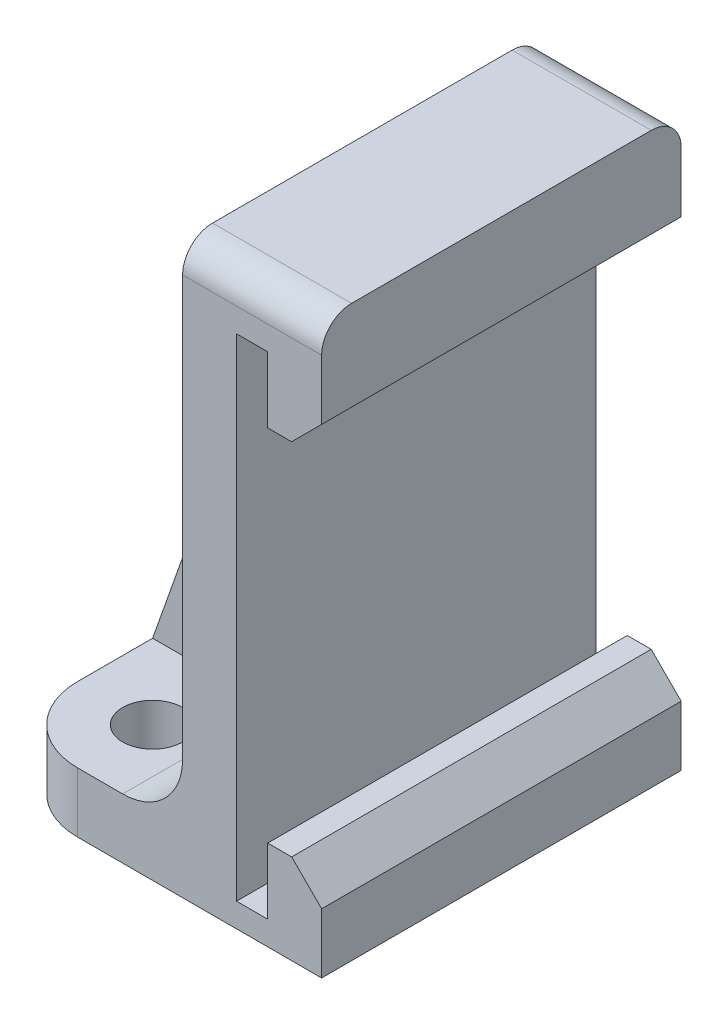
ISO-10303-21;
HEADER;
FILE_DESCRIPTION(('STEP AP214'),'2;1');
FILE_NAME('part.step','',(''),(''),'','','');
FILE_SCHEMA(('AUTOMOTIVE_DESIGN { 1 0 10303 214 1 1 1 1 }'));
ENDSEC;
DATA;
#1=APPLICATION_CONTEXT('core data for automotive mechanical design processes');
#2=APPLICATION_PROTOCOL_DEFINITION('international standard','automotive_design',2000,#1);
#3=PRODUCT_CONTEXT('',#1,'mechanical');
#4=PRODUCT('Part','Part','',(#3));
#5=PRODUCT_RELATED_PRODUCT_CATEGORY('part','',(#4));
#6=PRODUCT_DEFINITION_FORMATION('','',#4);
#7=PRODUCT_DEFINITION_CONTEXT('part definition',#1,'design');
#8=PRODUCT_DEFINITION('design','',#6,#7);
#9=PRODUCT_DEFINITION_SHAPE('','',#8);
#10=(LENGTH_UNIT() NAMED_UNIT(*) SI_UNIT(.MILLI.,.METRE.));
#11=(NAMED_UNIT(*) PLANE_ANGLE_UNIT() SI_UNIT($,.RADIAN.));
#12=(NAMED_UNIT(*) SI_UNIT($,.STERADIAN.) SOLID_ANGLE_UNIT());
#13=UNCERTAINTY_MEASURE_WITH_UNIT(LENGTH_MEASURE(1.E-05),#10,'distance_accuracy_value','');
#14=(GEOMETRIC_REPRESENTATION_CONTEXT(3) GLOBAL_UNCERTAINTY_ASSIGNED_CONTEXT((#13)) GLOBAL_UNIT_ASSIGNED_CONTEXT((#10,
#11,#12)) REPRESENTATION_CONTEXT('',''));
#15=CARTESIAN_POINT('',(0.,0.,0.));
#16=DIRECTION('',(0.,0.,1.));
#17=DIRECTION('',(1.,0.,0.));
#18=AXIS2_PLACEMENT_3D('',#15,#16,#17);
#19=CARTESIAN_POINT('',(-3.175,28.575,9.525));
#20=DIRECTION('',(1.,0.,0.));
#21=DIRECTION('',(0.,1.,0.));
#22=AXIS2_PLACEMENT_3D('',#19,#20,#21);
#23=PLANE('',#22);
#24=DIRECTION('',(0.,-1.,0.));
#25=VECTOR('',#24,1.);
#26=CARTESIAN_POINT('',(-3.175,28.575,9.525));
#27=LINE('',#26,#25);
#28=CARTESIAN_POINT('',(-3.175,26.9875,9.525));
#29=VERTEX_POINT('',#28);
#30=CARTESIAN_POINT('',(-3.175,4.7625,9.525));
#31=VERTEX_POINT('',#30);
#32=EDGE_CURVE('E262',#29,#31,#27,.T.);
#33=ORIENTED_EDGE('',*,*,#32,.F.);
#34=CARTESIAN_POINT('',(-3.175,26.9875,7.9375));
#35=DIRECTION('',(1.,0.,0.));
#36=DIRECTION('',(0.,1.,0.));
#37=AXIS2_PLACEMENT_3D('',#34,#35,#36);
#38=CIRCLE('',#37,1.5875);
#39=CARTESIAN_POINT('',(-3.175,28.575,7.9375));
#40=VERTEX_POINT('',#39);
#41=EDGE_CURVE('E206',#29,#40,#38,.F.);
#42=ORIENTED_EDGE('',*,*,#41,.T.);
#43=DIRECTION('',(0.,0.,-1.));
#44=VECTOR('',#43,1.);
#45=CARTESIAN_POINT('',(-3.175,28.575,9.525));
#46=LINE('',#45,#44);
#47=CARTESIAN_POINT('',(-3.175,28.575,1.5875));
#48=VERTEX_POINT('',#47);
#49=EDGE_CURVE('E200',#40,#48,#46,.T.);
#50=ORIENTED_EDGE('',*,*,#49,.T.);
#51=DIRECTION('',(0.,1.,0.));
#52=VECTOR('',#51,1.);
#53=CARTESIAN_POINT('',(-3.175,1.5875,1.5875));
#54=LINE('',#53,#52);
#55=CARTESIAN_POINT('',(-3.175,4.7625,1.5875));
#56=VERTEX_POINT('',#55);
#57=EDGE_CURVE('E204',#56,#48,#54,.T.);
#58=ORIENTED_EDGE('',*,*,#57,.F.);
#59=DIRECTION('',(0.,0.,-1.));
#60=VECTOR('',#59,1.);
#61=CARTESIAN_POINT('',(-3.175,4.7625,9.525));
#62=LINE('',#61,#60);
#63=EDGE_CURVE('E331',#56,#31,#62,.F.);
#64=ORIENTED_EDGE('',*,*,#63,.T.);
#65=EDGE_LOOP('',(#33,#42,#50,#58,#64));
#66=FACE_BOUND('',#65,.T.);
#67=ADVANCED_FACE('F33',(#66),#23,.F.);
#68=CARTESIAN_POINT('',(-12.7,1.5875,9.525));
#69=DIRECTION('',(0.,-1.,0.));
#70=DIRECTION('',(1.,0.,0.));
#71=AXIS2_PLACEMENT_3D('',#68,#69,#70);
#72=PLANE('',#71);
#73=CARTESIAN_POINT('',(-8.73125,1.5875,5.55625));
#74=DIRECTION('',(0.,1.,0.));
#75=DIRECTION('',(-1.,0.,0.));
#76=AXIS2_PLACEMENT_3D('',#73,#74,#75);
#77=CIRCLE('',#76,1.5875);
#78=CARTESIAN_POINT('',(-10.31875,1.5875,5.55625));
#79=VERTEX_POINT('',#78);
#80=EDGE_CURVE('E753',#79,#79,#77,.T.);
#81=ORIENTED_EDGE('',*,*,#80,.F.);
#82=EDGE_LOOP('',(#81));
#83=FACE_BOUND('',#82,.T.);
#84=DIRECTION('',(0.,0.,-1.));
#85=VECTOR('',#84,1.);
#86=CARTESIAN_POINT('',(-12.7,1.5875,9.525));
#87=LINE('',#86,#85);
#88=CARTESIAN_POINT('',(-12.7,1.5875,5.5626));
#89=VERTEX_POINT('',#88);
#90=CARTESIAN_POINT('',(-12.7,1.5875,1.5875));
#91=VERTEX_POINT('',#90);
#92=EDGE_CURVE('E312',#89,#91,#87,.T.);
#93=ORIENTED_EDGE('',*,*,#92,.F.);
#94=CARTESIAN_POINT('',(-8.7376,1.5875,5.5626));
#95=DIRECTION('',(0.,-1.,0.));
#96=DIRECTION('',(1.,0.,0.));
#97=AXIS2_PLACEMENT_3D('',#94,#95,#96);
#98=CIRCLE('',#97,3.9624);
#99=CARTESIAN_POINT('',(-8.7376,1.5875,9.525));
#100=VERTEX_POINT('',#99);
#101=EDGE_CURVE('E390',#89,#100,#98,.F.);
#102=ORIENTED_EDGE('',*,*,#101,.T.);
#103=DIRECTION('',(-1.,0.,0.));
#104=VECTOR('',#103,1.);
#105=CARTESIAN_POINT('',(-12.7,1.5875,9.525));
#106=LINE('',#105,#104);
#107=CARTESIAN_POINT('',(-6.35,1.5875,9.525));
#108=VERTEX_POINT('',#107);
#109=EDGE_CURVE('E264',#108,#100,#106,.T.);
#110=ORIENTED_EDGE('',*,*,#109,.F.);
#111=DIRECTION('',(0.,0.,-1.));
#112=VECTOR('',#111,1.);
#113=CARTESIAN_POINT('',(-6.35,1.5875,-9.525));
#114=LINE('',#113,#112);
#115=CARTESIAN_POINT('',(-6.35,1.5875,1.5875));
#116=VERTEX_POINT('',#115);
#117=EDGE_CURVE('E328',#108,#116,#114,.T.);
#118=ORIENTED_EDGE('',*,*,#117,.T.);
#119=DIRECTION('',(1.,0.,0.));
#120=VECTOR('',#119,1.);
#121=CARTESIAN_POINT('',(-12.7,1.5875,1.5875));
#122=LINE('',#121,#120);
#123=EDGE_CURVE('E231',#91,#116,#122,.T.);
#124=ORIENTED_EDGE('',*,*,#123,.F.);
#125=EDGE_LOOP('',(#93,#102,#110,#118,#124));
#126=FACE_BOUND('',#125,.T.);
#127=ADVANCED_FACE('F395',(#83,#126),#72,.F.);
#128=CARTESIAN_POINT('',(-6.35,4.7625,9.525));
#129=DIRECTION('',(0.,0.,1.));
#130=DIRECTION('',(1.,0.,0.));
#131=AXIS2_PLACEMENT_3D('',#128,#129,#130);
#132=CYLINDRICAL_SURFACE('',#131,3.175);
#133=CARTESIAN_POINT('',(-6.35,4.7625,1.5875));
#134=DIRECTION('',(0.,0.,-1.));
#135=DIRECTION('',(-1.,0.,0.));
#136=AXIS2_PLACEMENT_3D('',#133,#134,#135);
#137=CIRCLE('',#136,3.175);
#138=EDGE_CURVE('E220',#116,#56,#137,.F.);
#139=ORIENTED_EDGE('',*,*,#138,.F.);
#140=ORIENTED_EDGE('',*,*,#117,.F.);
#141=CARTESIAN_POINT('',(-6.35,4.7625,9.525));
#142=DIRECTION('',(0.,0.,-1.));
#143=DIRECTION('',(-1.,0.,0.));
#144=AXIS2_PLACEMENT_3D('',#141,#142,#143);
#145=CIRCLE('',#144,3.175);
#146=EDGE_CURVE('E338',#31,#108,#145,.T.);
#147=ORIENTED_EDGE('',*,*,#146,.F.);
#148=ORIENTED_EDGE('',*,*,#63,.F.);
#149=EDGE_LOOP('',(#139,#140,#147,#148));
#150=FACE_BOUND('',#149,.T.);
#151=ADVANCED_FACE('F475',(#150),#132,.F.);
#152=CARTESIAN_POINT('',(1.3335,-0.3175,9.525));
#153=DIRECTION('',(0.,-1.,0.));
#154=DIRECTION('',(1.,0.,0.));
#155=AXIS2_PLACEMENT_3D('',#152,#153,#154);
#156=PLANE('',#155);
#157=DIRECTION('',(-1.,0.,0.));
#158=VECTOR('',#157,1.);
#159=CARTESIAN_POINT('',(1.3335,-0.3175,-9.525));
#160=LINE('',#159,#158);
#161=CARTESIAN_POINT('',(1.3335,-0.3175,-9.525));
#162=VERTEX_POINT('',#161);
#163=CARTESIAN_POINT('',(-0.3175,-0.3175,-9.525));
#164=VERTEX_POINT('',#163);
#165=EDGE_CURVE('E238',#162,#164,#160,.T.);
#166=ORIENTED_EDGE('',*,*,#165,.T.);
#167=DIRECTION('',(0.,0.,-1.));
#168=VECTOR('',#167,1.);
#169=CARTESIAN_POINT('',(-0.3175,-0.3175,9.525));
#170=LINE('',#169,#168);
#171=CARTESIAN_POINT('',(-0.3175,-0.3175,9.525));
#172=VERTEX_POINT('',#171);
#173=EDGE_CURVE('E324',#172,#164,#170,.T.);
#174=ORIENTED_EDGE('',*,*,#173,.F.);
#175=DIRECTION('',(-1.,0.,0.));
#176=VECTOR('',#175,1.);
#177=CARTESIAN_POINT('',(1.3335,-0.3175,9.525));
#178=LINE('',#177,#176);
#179=CARTESIAN_POINT('',(1.3335,-0.3175,9.525));
#180=VERTEX_POINT('',#179);
#181=EDGE_CURVE('E246',#180,#172,#178,.T.);
#182=ORIENTED_EDGE('',*,*,#181,.F.);
#183=DIRECTION('',(0.,0.,-1.));
#184=VECTOR('',#183,1.);
#185=CARTESIAN_POINT('',(1.3335,-0.3175,9.525));
#186=LINE('',#185,#184);
#187=EDGE_CURVE('E275',#180,#162,#186,.T.);
#188=ORIENTED_EDGE('',*,*,#187,.T.);
#189=EDGE_LOOP('',(#166,#174,#182,#188));
#190=FACE_BOUND('',#189,.T.);
#191=ADVANCED_FACE('F436',(#190),#156,.F.);
#192=CARTESIAN_POINT('',(-0.3175,-0.3175,9.525));
#193=DIRECTION('',(-1.,0.,0.));
#194=DIRECTION('',(0.,0.,1.));
#195=AXIS2_PLACEMENT_3D('',#192,#193,#194);
#196=PLANE('',#195);
#197=DIRECTION('',(0.,1.,0.));
#198=VECTOR('',#197,1.);
#199=CARTESIAN_POINT('',(-0.3175,-0.3175,-9.525));
#200=LINE('',#199,#198);
#201=CARTESIAN_POINT('',(-0.3175,25.7175,-9.525));
#202=VERTEX_POINT('',#201);
#203=EDGE_CURVE('E241',#164,#202,#200,.T.);
#204=ORIENTED_EDGE('',*,*,#203,.T.);
#205=DIRECTION('',(0.,0.,-1.));
#206=VECTOR('',#205,1.);
#207=CARTESIAN_POINT('',(-0.3175,25.7175,9.525));
#208=LINE('',#207,#206);
#209=CARTESIAN_POINT('',(-0.3175,25.7175,9.525));
#210=VERTEX_POINT('',#209);
#211=EDGE_CURVE('E321',#210,#202,#208,.T.);
#212=ORIENTED_EDGE('',*,*,#211,.F.);
#213=DIRECTION('',(0.,1.,0.));
#214=VECTOR('',#213,1.);
#215=CARTESIAN_POINT('',(-0.3175,-0.3175,9.525));
#216=LINE('',#215,#214);
#217=EDGE_CURVE('E249',#172,#210,#216,.T.);
#218=ORIENTED_EDGE('',*,*,#217,.F.);
#219=ORIENTED_EDGE('',*,*,#173,.T.);
#220=EDGE_LOOP('',(#204,#212,#218,#219));
#221=FACE_BOUND('',#220,.T.);
#222=ADVANCED_FACE('F442',(#221),#196,.F.);
#223=CARTESIAN_POINT('',(-0.3175,25.7175,9.525));
#224=DIRECTION('',(0.,1.,0.));
#225=DIRECTION('',(0.,0.,1.));
#226=AXIS2_PLACEMENT_3D('',#223,#224,#225);
#227=PLANE('',#226);
#228=DIRECTION('',(1.,0.,0.));
#229=VECTOR('',#228,1.);
#230=CARTESIAN_POINT('',(-0.3175,25.7175,-9.525));
#231=LINE('',#230,#229);
#232=CARTESIAN_POINT('',(1.3335,25.7175,-9.525));
#233=VERTEX_POINT('',#232);
#234=EDGE_CURVE('E278',#202,#233,#231,.T.);
#235=ORIENTED_EDGE('',*,*,#234,.T.);
#236=DIRECTION('',(0.,0.,-1.));
#237=VECTOR('',#236,1.);
#238=CARTESIAN_POINT('',(1.3335,25.7175,9.525));
#239=LINE('',#238,#237);
#240=CARTESIAN_POINT('',(1.3335,25.7175,9.525));
#241=VERTEX_POINT('',#240);
#242=EDGE_CURVE('E318',#241,#233,#239,.T.);
#243=ORIENTED_EDGE('',*,*,#242,.F.);
#244=DIRECTION('',(1.,0.,0.));
#245=VECTOR('',#244,1.);
#246=CARTESIAN_POINT('',(-0.3175,25.7175,9.525));
#247=LINE('',#246,#245);
#248=EDGE_CURVE('E252',#210,#241,#247,.T.);
#249=ORIENTED_EDGE('',*,*,#248,.F.);
#250=ORIENTED_EDGE('',*,*,#211,.T.);
#251=EDGE_LOOP('',(#235,#243,#249,#250));
#252=FACE_BOUND('',#251,.T.);
#253=ADVANCED_FACE('F445',(#252),#227,.F.);
#254=CARTESIAN_POINT('',(1.3335,25.7175,9.525));
#255=DIRECTION('',(1.,0.,0.));
#256=DIRECTION('',(0.,1.,0.));
#257=AXIS2_PLACEMENT_3D('',#254,#255,#256);
#258=PLANE('',#257);
#259=DIRECTION('',(0.,-1.,0.));
#260=VECTOR('',#259,1.);
#261=CARTESIAN_POINT('',(1.3335,25.7175,-9.525));
#262=LINE('',#261,#260);
#263=CARTESIAN_POINT('',(1.3335,22.225,-9.525));
#264=VERTEX_POINT('',#263);
#265=EDGE_CURVE('E280',#233,#264,#262,.T.);
#266=ORIENTED_EDGE('',*,*,#265,.T.);
#267=DIRECTION('',(0.,0.,-1.));
#268=VECTOR('',#267,1.);
#269=CARTESIAN_POINT('',(1.3335,22.225,9.525));
#270=LINE('',#269,#268);
#271=CARTESIAN_POINT('',(1.3335,22.225,9.525));
#272=VERTEX_POINT('',#271);
#273=EDGE_CURVE('E315',#272,#264,#270,.T.);
#274=ORIENTED_EDGE('',*,*,#273,.F.);
#275=DIRECTION('',(0.,-1.,0.));
#276=VECTOR('',#275,1.);
#277=CARTESIAN_POINT('',(1.3335,25.7175,9.525));
#278=LINE('',#277,#276);
#279=EDGE_CURVE('E254',#241,#272,#278,.T.);
#280=ORIENTED_EDGE('',*,*,#279,.F.);
#281=ORIENTED_EDGE('',*,*,#242,.T.);
#282=EDGE_LOOP('',(#266,#274,#280,#281));
#283=FACE_BOUND('',#282,.T.);
#284=ADVANCED_FACE('F450',(#283),#258,.F.);
#285=CARTESIAN_POINT('',(4.191,22.225,9.525));
#286=DIRECTION('',(0.,1.,0.));
#287=DIRECTION('',(0.,0.,1.));
#288=AXIS2_PLACEMENT_3D('',#285,#286,#287);
#289=PLANE('',#288);
#290=DIRECTION('',(1.,0.,0.));
#291=VECTOR('',#290,1.);
#292=CARTESIAN_POINT('',(4.191,22.225,-9.525));
#293=LINE('',#292,#291);
#294=CARTESIAN_POINT('',(2.60349999999999,22.225,-9.525));
#295=VERTEX_POINT('',#294);
#296=EDGE_CURVE('E282',#264,#295,#293,.T.);
#297=ORIENTED_EDGE('',*,*,#296,.T.);
#298=DIRECTION('',(0.,0.,1.));
#299=VECTOR('',#298,1.);
#300=CARTESIAN_POINT('',(2.60349999999999,22.225,9.525));
#301=LINE('',#300,#299);
#302=CARTESIAN_POINT('',(2.60349999999999,22.225,9.525));
#303=VERTEX_POINT('',#302);
#304=EDGE_CURVE('E360',#295,#303,#301,.T.);
#305=ORIENTED_EDGE('',*,*,#304,.T.);
#306=DIRECTION('',(1.,0.,0.));
#307=VECTOR('',#306,1.);
#308=CARTESIAN_POINT('',(4.191,22.225,9.525));
#309=LINE('',#308,#307);
#310=EDGE_CURVE('E256',#272,#303,#309,.T.);
#311=ORIENTED_EDGE('',*,*,#310,.F.);
#312=ORIENTED_EDGE('',*,*,#273,.T.);
#313=EDGE_LOOP('',(#297,#305,#311,#312));
#314=FACE_BOUND('',#313,.T.);
#315=ADVANCED_FACE('F520',(#314),#289,.F.);
#316=CARTESIAN_POINT('',(4.19099999999999,28.575,9.525));
#317=DIRECTION('',(-1.,0.,0.));
#318=DIRECTION('',(0.,-1.,0.));
#319=AXIS2_PLACEMENT_3D('',#316,#317,#318);
#320=PLANE('',#319);
#321=DIRECTION('',(0.,1.,0.));
#322=VECTOR('',#321,1.);
#323=CARTESIAN_POINT('',(4.19099999999999,28.575,-9.525));
#324=LINE('',#323,#322);
#325=CARTESIAN_POINT('',(4.191,23.8125,-9.525));
#326=VERTEX_POINT('',#325);
#327=CARTESIAN_POINT('',(4.19099999999999,26.9875,-9.525));
#328=VERTEX_POINT('',#327);
#329=EDGE_CURVE('E285',#326,#328,#324,.T.);
#330=ORIENTED_EDGE('',*,*,#329,.T.);
#331=CARTESIAN_POINT('',(4.19099999999999,26.9875,-7.9375));
#332=DIRECTION('',(-1.,0.,0.));
#333=DIRECTION('',(0.,-1.,0.));
#334=AXIS2_PLACEMENT_3D('',#331,#332,#333);
#335=CIRCLE('',#334,1.5875);
#336=CARTESIAN_POINT('',(4.19099999999999,28.575,-7.93749999999999));
#337=VERTEX_POINT('',#336);
#338=EDGE_CURVE('E372',#328,#337,#335,.F.);
#339=ORIENTED_EDGE('',*,*,#338,.T.);
#340=DIRECTION('',(0.,0.,-1.));
#341=VECTOR('',#340,1.);
#342=CARTESIAN_POINT('',(4.19099999999999,28.575,9.525));
#343=LINE('',#342,#341);
#344=CARTESIAN_POINT('',(4.19099999999999,28.575,7.9375));
#345=VERTEX_POINT('',#344);
#346=EDGE_CURVE('E210',#345,#337,#343,.T.);
#347=ORIENTED_EDGE('',*,*,#346,.F.);
#348=CARTESIAN_POINT('',(4.19099999999999,26.9875,7.9375));
#349=DIRECTION('',(-1.,0.,0.));
#350=DIRECTION('',(0.,-1.,0.));
#351=AXIS2_PLACEMENT_3D('',#348,#349,#350);
#352=CIRCLE('',#351,1.5875);
#353=CARTESIAN_POINT('',(4.19099999999999,26.9875,9.525));
#354=VERTEX_POINT('',#353);
#355=EDGE_CURVE('E370',#345,#354,#352,.F.);
#356=ORIENTED_EDGE('',*,*,#355,.T.);
#357=DIRECTION('',(0.,1.,0.));
#358=VECTOR('',#357,1.);
#359=CARTESIAN_POINT('',(4.19099999999999,28.575,9.525));
#360=LINE('',#359,#358);
#361=CARTESIAN_POINT('',(4.191,23.8125,9.525));
#362=VERTEX_POINT('',#361);
#363=EDGE_CURVE('E259',#362,#354,#360,.T.);
#364=ORIENTED_EDGE('',*,*,#363,.F.);
#365=DIRECTION('',(0.,0.,-1.));
#366=VECTOR('',#365,1.);
#367=CARTESIAN_POINT('',(4.191,23.8125,9.525));
#368=LINE('',#367,#366);
#369=EDGE_CURVE('E357',#362,#326,#368,.T.);
#370=ORIENTED_EDGE('',*,*,#369,.T.);
#371=EDGE_LOOP('',(#330,#339,#347,#356,#364,#370));
#372=FACE_BOUND('',#371,.T.);
#373=ADVANCED_FACE('F461',(#372),#320,.F.);
#374=CARTESIAN_POINT('',(1.016,28.575,9.525));
#375=DIRECTION('',(0.,-1.,0.));
#376=DIRECTION('',(0.,0.,-1.));
#377=AXIS2_PLACEMENT_3D('',#374,#375,#376);
#378=PLANE('',#377);
#379=ORIENTED_EDGE('',*,*,#346,.T.);
#380=DIRECTION('',(-1.,0.,0.));
#381=VECTOR('',#380,1.);
#382=CARTESIAN_POINT('',(-3.175,28.575,-7.9375));
#383=LINE('',#382,#381);
#384=CARTESIAN_POINT('',(-3.175,28.575,-7.93749999999999));
#385=VERTEX_POINT('',#384);
#386=EDGE_CURVE('E364',#337,#385,#383,.T.);
#387=ORIENTED_EDGE('',*,*,#386,.T.);
#388=CARTESIAN_POINT('',(-3.175,28.575,-1.5875));
#389=VERTEX_POINT('',#388);
#390=EDGE_CURVE('E211',#389,#385,#46,.T.);
#391=ORIENTED_EDGE('',*,*,#390,.F.);
#392=DIRECTION('',(0.,0.,-1.));
#393=VECTOR('',#392,1.);
#394=CARTESIAN_POINT('',(-3.175,28.575,1.5875));
#395=LINE('',#394,#393);
#396=EDGE_CURVE('E226',#48,#389,#395,.T.);
#397=ORIENTED_EDGE('',*,*,#396,.F.);
#398=ORIENTED_EDGE('',*,*,#49,.F.);
#399=DIRECTION('',(-1.,0.,0.));
#400=VECTOR('',#399,1.);
#401=CARTESIAN_POINT('',(1.016,28.575,7.9375));
#402=LINE('',#401,#400);
#403=EDGE_CURVE('E362',#40,#345,#402,.F.);
#404=ORIENTED_EDGE('',*,*,#403,.T.);
#405=EDGE_LOOP('',(#379,#387,#391,#397,#398,#404));
#406=FACE_BOUND('',#405,.T.);
#407=ADVANCED_FACE('F235',(#406),#378,.F.);
#408=ORIENTED_EDGE('',*,*,#390,.T.);
#409=CARTESIAN_POINT('',(-3.175,26.9875,-7.9375));
#410=DIRECTION('',(1.,0.,0.));
#411=DIRECTION('',(0.,1.,0.));
#412=AXIS2_PLACEMENT_3D('',#409,#410,#411);
#413=CIRCLE('',#412,1.5875);
#414=CARTESIAN_POINT('',(-3.175,26.9875,-9.525));
#415=VERTEX_POINT('',#414);
#416=EDGE_CURVE('E366',#385,#415,#413,.F.);
#417=ORIENTED_EDGE('',*,*,#416,.T.);
#418=DIRECTION('',(0.,-1.,0.));
#419=VECTOR('',#418,1.);
#420=CARTESIAN_POINT('',(-3.175,28.575,-9.525));
#421=LINE('',#420,#419);
#422=CARTESIAN_POINT('',(-3.175,4.7625,-9.525));
#423=VERTEX_POINT('',#422);
#424=EDGE_CURVE('E288',#415,#423,#421,.T.);
#425=ORIENTED_EDGE('',*,*,#424,.T.);
#426=CARTESIAN_POINT('',(-3.175,4.7625,-1.5875));
#427=VERTEX_POINT('',#426);
#428=EDGE_CURVE('E332',#423,#427,#62,.F.);
#429=ORIENTED_EDGE('',*,*,#428,.T.);
#430=DIRECTION('',(0.,1.,0.));
#431=VECTOR('',#430,1.);
#432=CARTESIAN_POINT('',(-3.175,1.5875,-1.5875));
#433=LINE('',#432,#431);
#434=EDGE_CURVE('E478',#427,#389,#433,.T.);
#435=ORIENTED_EDGE('',*,*,#434,.T.);
#436=EDGE_LOOP('',(#408,#417,#425,#429,#435));
#437=FACE_BOUND('',#436,.T.);
#438=ADVANCED_FACE('F492',(#437),#23,.F.);
#439=CARTESIAN_POINT('',(-8.73125,1.5875,-5.55625));
#440=DIRECTION('',(0.,1.,0.));
#441=DIRECTION('',(-1.,0.,0.));
#442=AXIS2_PLACEMENT_3D('',#439,#440,#441);
#443=CIRCLE('',#442,1.5875);
#444=CARTESIAN_POINT('',(-10.31875,1.5875,-5.55625));
#445=VERTEX_POINT('',#444);
#446=EDGE_CURVE('E758',#445,#445,#443,.T.);
#447=ORIENTED_EDGE('',*,*,#446,.F.);
#448=EDGE_LOOP('',(#447));
#449=FACE_BOUND('',#448,.T.);
#450=DIRECTION('',(-1.,0.,0.));
#451=VECTOR('',#450,1.);
#452=CARTESIAN_POINT('',(-12.7,1.5875,-9.525));
#453=LINE('',#452,#451);
#454=CARTESIAN_POINT('',(-6.35,1.5875,-9.525));
#455=VERTEX_POINT('',#454);
#456=CARTESIAN_POINT('',(-8.7376,1.5875,-9.525));
#457=VERTEX_POINT('',#456);
#458=EDGE_CURVE('E290',#455,#457,#453,.T.);
#459=ORIENTED_EDGE('',*,*,#458,.T.);
#460=CARTESIAN_POINT('',(-8.7376,1.5875,-5.5626));
#461=DIRECTION('',(0.,-1.,0.));
#462=DIRECTION('',(1.,0.,0.));
#463=AXIS2_PLACEMENT_3D('',#460,#461,#462);
#464=CIRCLE('',#463,3.9624);
#465=CARTESIAN_POINT('',(-12.7,1.5875,-5.5626));
#466=VERTEX_POINT('',#465);
#467=EDGE_CURVE('E11',#457,#466,#464,.F.);
#468=ORIENTED_EDGE('',*,*,#467,.T.);
#469=CARTESIAN_POINT('',(-12.7,1.5875,-1.5875));
#470=VERTEX_POINT('',#469);
#471=EDGE_CURVE('E311',#470,#466,#87,.T.);
#472=ORIENTED_EDGE('',*,*,#471,.F.);
#473=DIRECTION('',(1.,0.,0.));
#474=VECTOR('',#473,1.);
#475=CARTESIAN_POINT('',(-12.7,1.5875,-1.5875));
#476=LINE('',#475,#474);
#477=CARTESIAN_POINT('',(-6.35,1.5875,-1.5875));
#478=VERTEX_POINT('',#477);
#479=EDGE_CURVE('E221',#470,#478,#476,.T.);
#480=ORIENTED_EDGE('',*,*,#479,.T.);
#481=EDGE_CURVE('E327',#478,#455,#114,.T.);
#482=ORIENTED_EDGE('',*,*,#481,.T.);
#483=EDGE_LOOP('',(#459,#468,#472,#480,#482));
#484=FACE_BOUND('',#483,.T.);
#485=ADVANCED_FACE('F485',(#449,#484),#72,.F.);
#486=CARTESIAN_POINT('',(-12.7,-1.5875,9.525));
#487=DIRECTION('',(1.,0.,0.));
#488=DIRECTION('',(0.,0.,-1.));
#489=AXIS2_PLACEMENT_3D('',#486,#487,#488);
#490=PLANE('',#489);
#491=DIRECTION('',(0.,0.,-1.));
#492=VECTOR('',#491,1.);
#493=CARTESIAN_POINT('',(-12.7,-1.5875,9.525));
#494=LINE('',#493,#492);
#495=CARTESIAN_POINT('',(-12.7,-1.5875,5.5626));
#496=VERTEX_POINT('',#495);
#497=CARTESIAN_POINT('',(-12.7,-1.5875,-5.5626));
#498=VERTEX_POINT('',#497);
#499=EDGE_CURVE('E308',#496,#498,#494,.T.);
#500=ORIENTED_EDGE('',*,*,#499,.F.);
#501=DIRECTION('',(0.,-1.,0.));
#502=VECTOR('',#501,1.);
#503=CARTESIAN_POINT('',(-12.7,-1.5875,5.5626));
#504=LINE('',#503,#502);
#505=EDGE_CURVE('E388',#496,#89,#504,.F.);
#506=ORIENTED_EDGE('',*,*,#505,.T.);
#507=ORIENTED_EDGE('',*,*,#92,.T.);
#508=DIRECTION('',(0.,0.,-1.));
#509=VECTOR('',#508,1.);
#510=CARTESIAN_POINT('',(-12.7,1.5875,1.5875));
#511=LINE('',#510,#509);
#512=EDGE_CURVE('E229',#91,#470,#511,.T.);
#513=ORIENTED_EDGE('',*,*,#512,.T.);
#514=ORIENTED_EDGE('',*,*,#471,.T.);
#515=DIRECTION('',(0.,-1.,0.));
#516=VECTOR('',#515,1.);
#517=CARTESIAN_POINT('',(-12.7,-1.5875,-5.5626));
#518=LINE('',#517,#516);
#519=EDGE_CURVE('E385',#466,#498,#518,.T.);
#520=ORIENTED_EDGE('',*,*,#519,.T.);
#521=EDGE_LOOP('',(#500,#506,#507,#513,#514,#520));
#522=FACE_BOUND('',#521,.T.);
#523=ADVANCED_FACE('F410',(#522),#490,.F.);
#524=CARTESIAN_POINT('',(-3.175,-1.5875,9.525));
#525=DIRECTION('',(0.,1.,0.));
#526=DIRECTION('',(0.,0.,1.));
#527=AXIS2_PLACEMENT_3D('',#524,#525,#526);
#528=PLANE('',#527);
#529=CARTESIAN_POINT('',(-8.73125,-1.5875,-5.55625));
#530=DIRECTION('',(0.,1.,0.));
#531=DIRECTION('',(0.,0.,1.));
#532=AXIS2_PLACEMENT_3D('',#529,#530,#531);
#533=CIRCLE('',#532,1.5875);
#534=CARTESIAN_POINT('',(-8.73125,-1.5875,-3.96875));
#535=VERTEX_POINT('',#534);
#536=EDGE_CURVE('E754',#535,#535,#533,.F.);
#537=ORIENTED_EDGE('',*,*,#536,.F.);
#538=EDGE_LOOP('',(#537));
#539=FACE_BOUND('',#538,.T.);
#540=CARTESIAN_POINT('',(-8.73125,-1.5875,5.55625));
#541=DIRECTION('',(0.,1.,0.));
#542=DIRECTION('',(0.,0.,1.));
#543=AXIS2_PLACEMENT_3D('',#540,#541,#542);
#544=CIRCLE('',#543,1.5875);
#545=CARTESIAN_POINT('',(-8.73125,-1.5875,7.14375));
#546=VERTEX_POINT('',#545);
#547=EDGE_CURVE('E481',#546,#546,#544,.F.);
#548=ORIENTED_EDGE('',*,*,#547,.F.);
#549=EDGE_LOOP('',(#548));
#550=FACE_BOUND('',#549,.T.);
#551=DIRECTION('',(1.,0.,0.));
#552=VECTOR('',#551,1.);
#553=CARTESIAN_POINT('',(-3.175,-1.5875,9.525));
#554=LINE('',#553,#552);
#555=CARTESIAN_POINT('',(-8.7376,-1.5875,9.525));
#556=VERTEX_POINT('',#555);
#557=CARTESIAN_POINT('',(4.191,-1.5875,9.525));
#558=VERTEX_POINT('',#557);
#559=EDGE_CURVE('E267',#556,#558,#554,.T.);
#560=ORIENTED_EDGE('',*,*,#559,.F.);
#561=CARTESIAN_POINT('',(-8.7376,-1.5875,5.5626));
#562=DIRECTION('',(0.,1.,0.));
#563=DIRECTION('',(0.,0.,1.));
#564=AXIS2_PLACEMENT_3D('',#561,#562,#563);
#565=CIRCLE('',#564,3.9624);
#566=EDGE_CURVE('E383',#556,#496,#565,.F.);
#567=ORIENTED_EDGE('',*,*,#566,.T.);
#568=ORIENTED_EDGE('',*,*,#499,.T.);
#569=CARTESIAN_POINT('',(-8.7376,-1.5875,-5.5626));
#570=DIRECTION('',(0.,1.,0.));
#571=DIRECTION('',(0.,0.,1.));
#572=AXIS2_PLACEMENT_3D('',#569,#570,#571);
#573=CIRCLE('',#572,3.9624);
#574=CARTESIAN_POINT('',(-8.7376,-1.5875,-9.525));
#575=VERTEX_POINT('',#574);
#576=EDGE_CURVE('E381',#498,#575,#573,.F.);
#577=ORIENTED_EDGE('',*,*,#576,.T.);
#578=DIRECTION('',(1.,0.,0.));
#579=VECTOR('',#578,1.);
#580=CARTESIAN_POINT('',(-3.175,-1.5875,-9.525));
#581=LINE('',#580,#579);
#582=CARTESIAN_POINT('',(4.191,-1.5875,-9.525));
#583=VERTEX_POINT('',#582);
#584=EDGE_CURVE('E292',#575,#583,#581,.T.);
#585=ORIENTED_EDGE('',*,*,#584,.T.);
#586=DIRECTION('',(0.,0.,-1.));
#587=VECTOR('',#586,1.);
#588=CARTESIAN_POINT('',(4.191,-1.5875,9.525));
#589=LINE('',#588,#587);
#590=EDGE_CURVE('E305',#558,#583,#589,.T.);
#591=ORIENTED_EDGE('',*,*,#590,.F.);
#592=EDGE_LOOP('',(#560,#567,#568,#577,#585,#591));
#593=FACE_BOUND('',#592,.T.);
#594=ADVANCED_FACE('F407',(#539,#550,#593),#528,.F.);
#595=CARTESIAN_POINT('',(4.191,0.,9.525));
#596=DIRECTION('',(-1.,0.,0.));
#597=DIRECTION('',(0.,0.,1.));
#598=AXIS2_PLACEMENT_3D('',#595,#596,#597);
#599=PLANE('',#598);
#600=DIRECTION('',(0.,1.,0.));
#601=VECTOR('',#600,1.);
#602=CARTESIAN_POINT('',(4.191,0.,-9.525));
#603=LINE('',#602,#601);
#604=CARTESIAN_POINT('',(4.191,1.58750000000001,-9.525));
#605=VERTEX_POINT('',#604);
#606=EDGE_CURVE('E294',#583,#605,#603,.T.);
#607=ORIENTED_EDGE('',*,*,#606,.T.);
#608=DIRECTION('',(0.,0.,1.));
#609=VECTOR('',#608,1.);
#610=CARTESIAN_POINT('',(4.191,1.58750000000001,9.525));
#611=LINE('',#610,#609);
#612=CARTESIAN_POINT('',(4.191,1.58750000000001,9.525));
#613=VERTEX_POINT('',#612);
#614=EDGE_CURVE('E351',#605,#613,#611,.T.);
#615=ORIENTED_EDGE('',*,*,#614,.T.);
#616=DIRECTION('',(0.,1.,0.));
#617=VECTOR('',#616,1.);
#618=CARTESIAN_POINT('',(4.191,-1.5875,9.525));
#619=LINE('',#618,#617);
#620=EDGE_CURVE('E269',#558,#613,#619,.T.);
#621=ORIENTED_EDGE('',*,*,#620,.F.);
#622=ORIENTED_EDGE('',*,*,#590,.T.);
#623=EDGE_LOOP('',(#607,#615,#621,#622));
#624=FACE_BOUND('',#623,.T.);
#625=ADVANCED_FACE('F419',(#624),#599,.F.);
#626=CARTESIAN_POINT('',(4.191,3.175,9.525));
#627=DIRECTION('',(0.,-1.,0.));
#628=DIRECTION('',(1.,0.,0.));
#629=AXIS2_PLACEMENT_3D('',#626,#627,#628);
#630=PLANE('',#629);
#631=DIRECTION('',(-1.,0.,0.));
#632=VECTOR('',#631,1.);
#633=CARTESIAN_POINT('',(4.191,3.175,9.525));
#634=LINE('',#633,#632);
#635=CARTESIAN_POINT('',(2.60350000000001,3.175,9.525));
#636=VERTEX_POINT('',#635);
#637=CARTESIAN_POINT('',(1.3335,3.175,9.525));
#638=VERTEX_POINT('',#637);
#639=EDGE_CURVE('E272',#636,#638,#634,.T.);
#640=ORIENTED_EDGE('',*,*,#639,.F.);
#641=DIRECTION('',(0.,0.,-1.));
#642=VECTOR('',#641,1.);
#643=CARTESIAN_POINT('',(2.60350000000001,3.175,9.525));
#644=LINE('',#643,#642);
#645=CARTESIAN_POINT('',(2.60350000000001,3.175,-9.525));
#646=VERTEX_POINT('',#645);
#647=EDGE_CURVE('E344',#636,#646,#644,.T.);
#648=ORIENTED_EDGE('',*,*,#647,.T.);
#649=DIRECTION('',(-1.,0.,0.));
#650=VECTOR('',#649,1.);
#651=CARTESIAN_POINT('',(4.191,3.175,-9.525));
#652=LINE('',#651,#650);
#653=CARTESIAN_POINT('',(1.3335,3.175,-9.525));
#654=VERTEX_POINT('',#653);
#655=EDGE_CURVE('E297',#646,#654,#652,.T.);
#656=ORIENTED_EDGE('',*,*,#655,.T.);
#657=DIRECTION('',(0.,0.,-1.));
#658=VECTOR('',#657,1.);
#659=CARTESIAN_POINT('',(1.3335,3.175,9.525));
#660=LINE('',#659,#658);
#661=EDGE_CURVE('E302',#638,#654,#660,.T.);
#662=ORIENTED_EDGE('',*,*,#661,.F.);
#663=EDGE_LOOP('',(#640,#648,#656,#662));
#664=FACE_BOUND('',#663,.T.);
#665=ADVANCED_FACE('F426',(#664),#630,.F.);
#666=CARTESIAN_POINT('',(1.3335,3.175,9.525));
#667=DIRECTION('',(1.,0.,0.));
#668=DIRECTION('',(0.,1.,0.));
#669=AXIS2_PLACEMENT_3D('',#666,#667,#668);
#670=PLANE('',#669);
#671=DIRECTION('',(0.,-1.,0.));
#672=VECTOR('',#671,1.);
#673=CARTESIAN_POINT('',(1.3335,3.175,-9.525));
#674=LINE('',#673,#672);
#675=EDGE_CURVE('E250',#654,#162,#674,.T.);
#676=ORIENTED_EDGE('',*,*,#675,.T.);
#677=ORIENTED_EDGE('',*,*,#187,.F.);
#678=DIRECTION('',(0.,-1.,0.));
#679=VECTOR('',#678,1.);
#680=CARTESIAN_POINT('',(1.3335,3.175,9.525));
#681=LINE('',#680,#679);
#682=EDGE_CURVE('E274',#638,#180,#681,.T.);
#683=ORIENTED_EDGE('',*,*,#682,.F.);
#684=ORIENTED_EDGE('',*,*,#661,.T.);
#685=EDGE_LOOP('',(#676,#677,#683,#684));
#686=FACE_BOUND('',#685,.T.);
#687=ADVANCED_FACE('F432',(#686),#670,.F.);
#688=CARTESIAN_POINT('',(0.,0.,9.525));
#689=DIRECTION('',(0.,0.,-1.));
#690=DIRECTION('',(-1.,0.,0.));
#691=AXIS2_PLACEMENT_3D('',#688,#689,#690);
#692=PLANE('',#691);
#693=ORIENTED_EDGE('',*,*,#109,.T.);
#694=DIRECTION('',(0.,-1.,0.));
#695=VECTOR('',#694,1.);
#696=CARTESIAN_POINT('',(-8.7376,0.,9.525));
#697=LINE('',#696,#695);
#698=EDGE_CURVE('E378',#100,#556,#697,.T.);
#699=ORIENTED_EDGE('',*,*,#698,.T.);
#700=ORIENTED_EDGE('',*,*,#559,.T.);
#701=ORIENTED_EDGE('',*,*,#620,.T.);
#702=DIRECTION('',(0.707106781186547,-0.707106781186548,0.));
#703=VECTOR('',#702,1.);
#704=CARTESIAN_POINT('',(2.60350000000001,3.175,9.525));
#705=LINE('',#704,#703);
#706=EDGE_CURVE('E355',#613,#636,#705,.F.);
#707=ORIENTED_EDGE('',*,*,#706,.T.);
#708=ORIENTED_EDGE('',*,*,#639,.T.);
#709=ORIENTED_EDGE('',*,*,#682,.T.);
#710=ORIENTED_EDGE('',*,*,#181,.T.);
#711=ORIENTED_EDGE('',*,*,#217,.T.);
#712=ORIENTED_EDGE('',*,*,#248,.T.);
#713=ORIENTED_EDGE('',*,*,#279,.T.);
#714=ORIENTED_EDGE('',*,*,#310,.T.);
#715=DIRECTION('',(-0.707106781186551,-0.707106781186545,0.));
#716=VECTOR('',#715,1.);
#717=CARTESIAN_POINT('',(4.191,23.8125,9.525));
#718=LINE('',#717,#716);
#719=EDGE_CURVE('E353',#303,#362,#718,.F.);
#720=ORIENTED_EDGE('',*,*,#719,.T.);
#721=ORIENTED_EDGE('',*,*,#363,.T.);
#722=DIRECTION('',(-1.,0.,0.));
#723=VECTOR('',#722,1.);
#724=CARTESIAN_POINT('',(0.,26.9875,9.525));
#725=LINE('',#724,#723);
#726=EDGE_CURVE('E374',#354,#29,#725,.T.);
#727=ORIENTED_EDGE('',*,*,#726,.T.);
#728=ORIENTED_EDGE('',*,*,#32,.T.);
#729=ORIENTED_EDGE('',*,*,#146,.T.);
#730=EDGE_LOOP('',(#693,#699,#700,#701,#707,#708,#709,#710,#711,#712,#713,#714,#720,#721,#727,
#728,#729));
#731=FACE_BOUND('',#730,.T.);
#732=ADVANCED_FACE('F401',(#731),#692,.F.);
#733=CARTESIAN_POINT('',(0.,0.,-9.525));
#734=DIRECTION('',(0.,0.,-1.));
#735=DIRECTION('',(-1.,0.,0.));
#736=AXIS2_PLACEMENT_3D('',#733,#734,#735);
#737=PLANE('',#736);
#738=ORIENTED_EDGE('',*,*,#584,.F.);
#739=DIRECTION('',(0.,-1.,0.));
#740=VECTOR('',#739,1.);
#741=CARTESIAN_POINT('',(-8.7376,1.5875,-9.525));
#742=LINE('',#741,#740);
#743=EDGE_CURVE('E41',#575,#457,#742,.F.);
#744=ORIENTED_EDGE('',*,*,#743,.T.);
#745=ORIENTED_EDGE('',*,*,#458,.F.);
#746=CARTESIAN_POINT('',(-6.35,4.7625,-9.525));
#747=DIRECTION('',(0.,0.,-1.));
#748=DIRECTION('',(-1.,0.,0.));
#749=AXIS2_PLACEMENT_3D('',#746,#747,#748);
#750=CIRCLE('',#749,3.175);
#751=EDGE_CURVE('E335',#455,#423,#750,.F.);
#752=ORIENTED_EDGE('',*,*,#751,.T.);
#753=ORIENTED_EDGE('',*,*,#424,.F.);
#754=DIRECTION('',(-1.,0.,0.));
#755=VECTOR('',#754,1.);
#756=CARTESIAN_POINT('',(4.19099999999999,26.9875,-9.525));
#757=LINE('',#756,#755);
#758=EDGE_CURVE('E368',#415,#328,#757,.F.);
#759=ORIENTED_EDGE('',*,*,#758,.T.);
#760=ORIENTED_EDGE('',*,*,#329,.F.);
#761=DIRECTION('',(0.707106781186551,0.707106781186545,0.));
#762=VECTOR('',#761,1.);
#763=CARTESIAN_POINT('',(-9.81075000000002,9.8107500000001,-9.525));
#764=LINE('',#763,#762);
#765=EDGE_CURVE('E347',#326,#295,#764,.F.);
#766=ORIENTED_EDGE('',*,*,#765,.T.);
#767=ORIENTED_EDGE('',*,*,#296,.F.);
#768=ORIENTED_EDGE('',*,*,#265,.F.);
#769=ORIENTED_EDGE('',*,*,#234,.F.);
#770=ORIENTED_EDGE('',*,*,#203,.F.);
#771=ORIENTED_EDGE('',*,*,#165,.F.);
#772=ORIENTED_EDGE('',*,*,#675,.F.);
#773=ORIENTED_EDGE('',*,*,#655,.F.);
#774=DIRECTION('',(-0.707106781186547,0.707106781186548,0.));
#775=VECTOR('',#774,1.);
#776=CARTESIAN_POINT('',(2.88925000000001,2.88925,-9.525));
#777=LINE('',#776,#775);
#778=EDGE_CURVE('E349',#646,#605,#777,.F.);
#779=ORIENTED_EDGE('',*,*,#778,.T.);
#780=ORIENTED_EDGE('',*,*,#606,.F.);
#781=EDGE_LOOP('',(#738,#744,#745,#752,#753,#759,#760,#766,#767,#768,#769,#770,#771,#772,#773,
#779,#780));
#782=FACE_BOUND('',#781,.T.);
#783=ADVANCED_FACE('F414',(#782),#737,.T.);
#784=ORIENTED_EDGE('',*,*,#481,.F.);
#785=CARTESIAN_POINT('',(-6.35,4.7625,-1.5875));
#786=DIRECTION('',(0.,0.,-1.));
#787=DIRECTION('',(-1.,0.,0.));
#788=AXIS2_PLACEMENT_3D('',#785,#786,#787);
#789=CIRCLE('',#788,3.175);
#790=EDGE_CURVE('E340',#478,#427,#789,.F.);
#791=ORIENTED_EDGE('',*,*,#790,.T.);
#792=ORIENTED_EDGE('',*,*,#428,.F.);
#793=ORIENTED_EDGE('',*,*,#751,.F.);
#794=EDGE_LOOP('',(#784,#791,#792,#793));
#795=FACE_BOUND('',#794,.T.);
#796=ADVANCED_FACE('F489',(#795),#132,.F.);
#797=CARTESIAN_POINT('',(0.,0.,1.5875));
#798=DIRECTION('',(0.,0.,-1.));
#799=DIRECTION('',(-1.,0.,0.));
#800=AXIS2_PLACEMENT_3D('',#797,#798,#799);
#801=PLANE('',#800);
#802=ORIENTED_EDGE('',*,*,#123,.T.);
#803=ORIENTED_EDGE('',*,*,#138,.T.);
#804=ORIENTED_EDGE('',*,*,#57,.T.);
#805=DIRECTION('',(-0.332820117735137,-0.94299033358289,0.));
#806=VECTOR('',#805,1.);
#807=CARTESIAN_POINT('',(-3.175,28.575,1.5875));
#808=LINE('',#807,#806);
#809=EDGE_CURVE('E217',#48,#91,#808,.T.);
#810=ORIENTED_EDGE('',*,*,#809,.T.);
#811=EDGE_LOOP('',(#802,#803,#804,#810));
#812=FACE_BOUND('',#811,.T.);
#813=ADVANCED_FACE('F216',(#812),#801,.F.);
#814=CARTESIAN_POINT('',(0.,0.,-1.5875));
#815=DIRECTION('',(0.,0.,-1.));
#816=DIRECTION('',(-1.,0.,0.));
#817=AXIS2_PLACEMENT_3D('',#814,#815,#816);
#818=PLANE('',#817);
#819=ORIENTED_EDGE('',*,*,#790,.F.);
#820=ORIENTED_EDGE('',*,*,#479,.F.);
#821=DIRECTION('',(-0.332820117735137,-0.94299033358289,0.));
#822=VECTOR('',#821,1.);
#823=CARTESIAN_POINT('',(-3.175,28.575,-1.5875));
#824=LINE('',#823,#822);
#825=EDGE_CURVE('E480',#389,#470,#824,.T.);
#826=ORIENTED_EDGE('',*,*,#825,.F.);
#827=ORIENTED_EDGE('',*,*,#434,.F.);
#828=EDGE_LOOP('',(#819,#820,#826,#827));
#829=FACE_BOUND('',#828,.T.);
#830=ADVANCED_FACE('F493',(#829),#818,.T.);
#831=CARTESIAN_POINT('',(-3.175,28.575,1.5875));
#832=DIRECTION('',(0.94299033358289,-0.332820117735137,0.));
#833=DIRECTION('',(0.332820117735137,0.94299033358289,0.));
#834=AXIS2_PLACEMENT_3D('',#831,#832,#833);
#835=PLANE('',#834);
#836=ORIENTED_EDGE('',*,*,#825,.T.);
#837=ORIENTED_EDGE('',*,*,#512,.F.);
#838=ORIENTED_EDGE('',*,*,#809,.F.);
#839=ORIENTED_EDGE('',*,*,#396,.T.);
#840=EDGE_LOOP('',(#836,#837,#838,#839));
#841=FACE_BOUND('',#840,.T.);
#842=ADVANCED_FACE('F225',(#841),#835,.F.);
#843=CARTESIAN_POINT('',(-8.73125,-6.07762806053458,5.55625));
#844=DIRECTION('',(0.,1.,0.));
#845=DIRECTION('',(-1.,0.,0.));
#846=AXIS2_PLACEMENT_3D('',#843,#844,#845);
#847=CYLINDRICAL_SURFACE('',#846,1.5875);
#848=ORIENTED_EDGE('',*,*,#547,.T.);
#849=EDGE_LOOP('',(#848));
#850=FACE_BOUND('',#849,.T.);
#851=ORIENTED_EDGE('',*,*,#80,.T.);
#852=EDGE_LOOP('',(#851));
#853=FACE_BOUND('',#852,.T.);
#854=ADVANCED_FACE('F500',(#850,#853),#847,.F.);
#855=CARTESIAN_POINT('',(-8.73125,-6.07762806053458,-5.55625));
#856=DIRECTION('',(0.,1.,0.));
#857=DIRECTION('',(-1.,0.,0.));
#858=AXIS2_PLACEMENT_3D('',#855,#856,#857);
#859=CYLINDRICAL_SURFACE('',#858,1.5875);
#860=ORIENTED_EDGE('',*,*,#536,.T.);
#861=EDGE_LOOP('',(#860));
#862=FACE_BOUND('',#861,.T.);
#863=ORIENTED_EDGE('',*,*,#446,.T.);
#864=EDGE_LOOP('',(#863));
#865=FACE_BOUND('',#864,.T.);
#866=ADVANCED_FACE('F537',(#862,#865),#859,.F.);
#867=CARTESIAN_POINT('',(2.60350000000001,3.175,9.525));
#868=DIRECTION('',(-0.707106781186548,-0.707106781186547,0.));
#869=DIRECTION('',(0.,0.,-1.));
#870=AXIS2_PLACEMENT_3D('',#867,#868,#869);
#871=PLANE('',#870);
#872=ORIENTED_EDGE('',*,*,#706,.F.);
#873=ORIENTED_EDGE('',*,*,#614,.F.);
#874=ORIENTED_EDGE('',*,*,#778,.F.);
#875=ORIENTED_EDGE('',*,*,#647,.F.);
#876=EDGE_LOOP('',(#872,#873,#874,#875));
#877=FACE_BOUND('',#876,.T.);
#878=ADVANCED_FACE('F424',(#877),#871,.F.);
#879=CARTESIAN_POINT('',(4.191,23.8125,9.525));
#880=DIRECTION('',(-0.707106781186545,0.707106781186551,0.));
#881=DIRECTION('',(0.,0.,-1.));
#882=AXIS2_PLACEMENT_3D('',#879,#880,#881);
#883=PLANE('',#882);
#884=ORIENTED_EDGE('',*,*,#719,.F.);
#885=ORIENTED_EDGE('',*,*,#304,.F.);
#886=ORIENTED_EDGE('',*,*,#765,.F.);
#887=ORIENTED_EDGE('',*,*,#369,.F.);
#888=EDGE_LOOP('',(#884,#885,#886,#887));
#889=FACE_BOUND('',#888,.T.);
#890=ADVANCED_FACE('F458',(#889),#883,.F.);
#891=CARTESIAN_POINT('',(1.016,26.9875,-7.9375));
#892=DIRECTION('',(1.,0.,0.));
#893=DIRECTION('',(0.,0.,-1.));
#894=AXIS2_PLACEMENT_3D('',#891,#892,#893);
#895=CYLINDRICAL_SURFACE('',#894,1.5875);
#896=ORIENTED_EDGE('',*,*,#338,.F.);
#897=ORIENTED_EDGE('',*,*,#758,.F.);
#898=ORIENTED_EDGE('',*,*,#416,.F.);
#899=ORIENTED_EDGE('',*,*,#386,.F.);
#900=EDGE_LOOP('',(#896,#897,#898,#899));
#901=FACE_BOUND('',#900,.T.);
#902=ADVANCED_FACE('F467',(#901),#895,.T.);
#903=CARTESIAN_POINT('',(0.,26.9875,7.9375));
#904=DIRECTION('',(-1.,0.,0.));
#905=DIRECTION('',(0.,0.,1.));
#906=AXIS2_PLACEMENT_3D('',#903,#904,#905);
#907=CYLINDRICAL_SURFACE('',#906,1.5875);
#908=ORIENTED_EDGE('',*,*,#355,.F.);
#909=ORIENTED_EDGE('',*,*,#403,.F.);
#910=ORIENTED_EDGE('',*,*,#41,.F.);
#911=ORIENTED_EDGE('',*,*,#726,.F.);
#912=EDGE_LOOP('',(#908,#909,#910,#911));
#913=FACE_BOUND('',#912,.T.);
#914=ADVANCED_FACE('F472',(#913),#907,.T.);
#915=CARTESIAN_POINT('',(-8.7376,0.,5.5626));
#916=DIRECTION('',(0.,-1.,0.));
#917=DIRECTION('',(0.,0.,-1.));
#918=AXIS2_PLACEMENT_3D('',#915,#916,#917);
#919=CYLINDRICAL_SURFACE('',#918,3.9624);
#920=ORIENTED_EDGE('',*,*,#101,.F.);
#921=ORIENTED_EDGE('',*,*,#505,.F.);
#922=ORIENTED_EDGE('',*,*,#566,.F.);
#923=ORIENTED_EDGE('',*,*,#698,.F.);
#924=EDGE_LOOP('',(#920,#921,#922,#923));
#925=FACE_BOUND('',#924,.T.);
#926=ADVANCED_FACE('F404',(#925),#919,.T.);
#927=CARTESIAN_POINT('',(-8.7376,-1.5875,-5.5626));
#928=DIRECTION('',(0.,1.,0.));
#929=DIRECTION('',(0.,0.,1.));
#930=AXIS2_PLACEMENT_3D('',#927,#928,#929);
#931=CYLINDRICAL_SURFACE('',#930,3.9624);
#932=ORIENTED_EDGE('',*,*,#467,.F.);
#933=ORIENTED_EDGE('',*,*,#743,.F.);
#934=ORIENTED_EDGE('',*,*,#576,.F.);
#935=ORIENTED_EDGE('',*,*,#519,.F.);
#936=EDGE_LOOP('',(#932,#933,#934,#935));
#937=FACE_BOUND('',#936,.T.);
#938=ADVANCED_FACE('F35',(#937),#931,.T.);
#939=CLOSED_SHELL('',(#67,#127,#151,#191,#222,#253,#284,#315,#373,#407,#438,#485,#523,#594,#625,
#665,#687,#732,#783,#796,#813,#830,#842,#854,#866,#878,#890,#902,#914,#926,#938));
#940=MANIFOLD_SOLID_BREP('B2',#939);
#941=ADVANCED_BREP_SHAPE_REPRESENTATION('',(#18,#940),#14);
#942=SHAPE_DEFINITION_REPRESENTATION(#9,#941);
ENDSEC;
END-ISO-10303-21;
